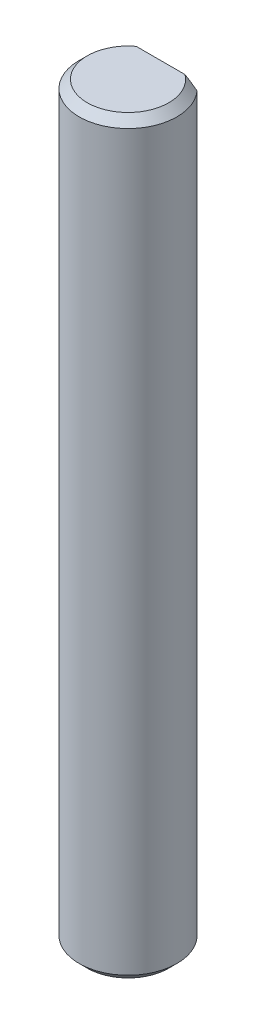
ISO-10303-21;
HEADER;
FILE_DESCRIPTION(('STEP AP214'),'2;1');
FILE_NAME('part.step','',(''),(''),'','','');
FILE_SCHEMA(('AUTOMOTIVE_DESIGN { 1 0 10303 214 1 1 1 1 }'));
ENDSEC;
DATA;
#1=APPLICATION_CONTEXT('core data for automotive mechanical design processes');
#2=APPLICATION_PROTOCOL_DEFINITION('international standard','automotive_design',2000,#1);
#3=PRODUCT_CONTEXT('',#1,'mechanical');
#4=PRODUCT('Part','Part','',(#3));
#5=PRODUCT_RELATED_PRODUCT_CATEGORY('part','',(#4));
#6=PRODUCT_DEFINITION_FORMATION('','',#4);
#7=PRODUCT_DEFINITION_CONTEXT('part definition',#1,'design');
#8=PRODUCT_DEFINITION('design','',#6,#7);
#9=PRODUCT_DEFINITION_SHAPE('','',#8);
#10=(LENGTH_UNIT() NAMED_UNIT(*) SI_UNIT(.MILLI.,.METRE.));
#11=(NAMED_UNIT(*) PLANE_ANGLE_UNIT() SI_UNIT($,.RADIAN.));
#12=(NAMED_UNIT(*) SI_UNIT($,.STERADIAN.) SOLID_ANGLE_UNIT());
#13=UNCERTAINTY_MEASURE_WITH_UNIT(LENGTH_MEASURE(1.E-05),#10,'distance_accuracy_value','');
#14=(GEOMETRIC_REPRESENTATION_CONTEXT(3) GLOBAL_UNCERTAINTY_ASSIGNED_CONTEXT((#13)) GLOBAL_UNIT_ASSIGNED_CONTEXT((#10,
#11,#12)) REPRESENTATION_CONTEXT('',''));
#15=CARTESIAN_POINT('',(0.,0.,0.));
#16=DIRECTION('',(0.,0.,1.));
#17=DIRECTION('',(1.,0.,0.));
#18=AXIS2_PLACEMENT_3D('',#15,#16,#17);
#19=CARTESIAN_POINT('',(0.,46.,0.));
#20=DIRECTION('',(0.,-1.,0.));
#21=DIRECTION('',(0.,0.,-1.));
#22=AXIS2_PLACEMENT_3D('',#19,#20,#21);
#23=CYLINDRICAL_SURFACE('',#22,3.);
#24=CARTESIAN_POINT('',(0.,45.5,0.));
#25=DIRECTION('',(0.,1.,0.));
#26=DIRECTION('',(0.,0.,1.));
#27=AXIS2_PLACEMENT_3D('',#24,#25,#26);
#28=CIRCLE('',#27,3.);
#29=CARTESIAN_POINT('',(2.23606797749979,45.5,-2.));
#30=VERTEX_POINT('',#29);
#31=CARTESIAN_POINT('',(-2.23606797749979,45.5,-2.));
#32=VERTEX_POINT('',#31);
#33=EDGE_CURVE('E124',#30,#32,#28,.F.);
#34=ORIENTED_EDGE('',*,*,#33,.T.);
#35=DIRECTION('',(0.,1.,0.));
#36=VECTOR('',#35,1.);
#37=CARTESIAN_POINT('',(-2.23606797749979,40.,-2.));
#38=LINE('',#37,#36);
#39=CARTESIAN_POINT('',(-2.23606797749979,40.,-2.));
#40=VERTEX_POINT('',#39);
#41=EDGE_CURVE('E119',#40,#32,#38,.T.);
#42=ORIENTED_EDGE('',*,*,#41,.F.);
#43=CARTESIAN_POINT('',(0.,40.,0.));
#44=DIRECTION('',(0.,1.,0.));
#45=DIRECTION('',(0.,0.,1.));
#46=AXIS2_PLACEMENT_3D('',#43,#44,#45);
#47=CIRCLE('',#46,3.);
#48=CARTESIAN_POINT('',(2.23606797749979,40.,-2.));
#49=VERTEX_POINT('',#48);
#50=EDGE_CURVE('E114',#49,#40,#47,.T.);
#51=ORIENTED_EDGE('',*,*,#50,.F.);
#52=DIRECTION('',(0.,1.,0.));
#53=VECTOR('',#52,1.);
#54=CARTESIAN_POINT('',(2.23606797749979,40.,-2.));
#55=LINE('',#54,#53);
#56=EDGE_CURVE('E121',#49,#30,#55,.T.);
#57=ORIENTED_EDGE('',*,*,#56,.T.);
#58=EDGE_LOOP('',(#34,#42,#51,#57));
#59=FACE_BOUND('',#58,.T.);
#60=CARTESIAN_POINT('',(0.,6.,0.));
#61=DIRECTION('',(0.,-1.,0.));
#62=DIRECTION('',(0.,0.,-1.));
#63=AXIS2_PLACEMENT_3D('',#60,#61,#62);
#64=CIRCLE('',#63,3.);
#65=CARTESIAN_POINT('',(-2.23606797749979,6.,-2.));
#66=VERTEX_POINT('',#65);
#67=CARTESIAN_POINT('',(2.23606797749979,6.,-2.));
#68=VERTEX_POINT('',#67);
#69=EDGE_CURVE('E94',#66,#68,#64,.T.);
#70=ORIENTED_EDGE('',*,*,#69,.F.);
#71=DIRECTION('',(0.,-1.,0.));
#72=VECTOR('',#71,1.);
#73=CARTESIAN_POINT('',(-2.23606797749979,6.,-2.));
#74=LINE('',#73,#72);
#75=CARTESIAN_POINT('',(-2.23606797749979,0.499999999999986,-2.));
#76=VERTEX_POINT('',#75);
#77=EDGE_CURVE('E105',#66,#76,#74,.T.);
#78=ORIENTED_EDGE('',*,*,#77,.T.);
#79=CARTESIAN_POINT('',(0.,0.499999999999987,0.));
#80=DIRECTION('',(0.,1.,0.));
#81=DIRECTION('',(0.,0.,1.));
#82=AXIS2_PLACEMENT_3D('',#79,#80,#81);
#83=CIRCLE('',#82,3.);
#84=CARTESIAN_POINT('',(2.23606797749979,0.499999999999986,-2.));
#85=VERTEX_POINT('',#84);
#86=EDGE_CURVE('E109',#76,#85,#83,.T.);
#87=ORIENTED_EDGE('',*,*,#86,.T.);
#88=DIRECTION('',(0.,-1.,0.));
#89=VECTOR('',#88,1.);
#90=CARTESIAN_POINT('',(2.23606797749979,6.,-2.));
#91=LINE('',#90,#89);
#92=EDGE_CURVE('E103',#68,#85,#91,.T.);
#93=ORIENTED_EDGE('',*,*,#92,.F.);
#94=EDGE_LOOP('',(#70,#78,#87,#93));
#95=FACE_BOUND('',#94,.T.);
#96=ADVANCED_FACE('F35',(#59,#95),#23,.T.);
#97=CARTESIAN_POINT('',(0.,46.,0.));
#98=DIRECTION('',(0.,1.,0.));
#99=DIRECTION('',(0.,0.,1.));
#100=AXIS2_PLACEMENT_3D('',#97,#98,#99);
#101=PLANE('',#100);
#102=DIRECTION('',(1.,0.,0.));
#103=VECTOR('',#102,1.);
#104=CARTESIAN_POINT('',(-2.23606797749979,46.,-2.));
#105=LINE('',#104,#103);
#106=CARTESIAN_POINT('',(-1.49999999999999,46.,-2.));
#107=VERTEX_POINT('',#106);
#108=CARTESIAN_POINT('',(1.49999999999999,46.,-2.));
#109=VERTEX_POINT('',#108);
#110=EDGE_CURVE('E64',#107,#109,#105,.T.);
#111=ORIENTED_EDGE('',*,*,#110,.F.);
#112=CARTESIAN_POINT('',(0.,46.,0.));
#113=DIRECTION('',(0.,1.,0.));
#114=DIRECTION('',(0.,0.,1.));
#115=AXIS2_PLACEMENT_3D('',#112,#113,#114);
#116=CIRCLE('',#115,2.5);
#117=EDGE_CURVE('E132',#107,#109,#116,.T.);
#118=ORIENTED_EDGE('',*,*,#117,.T.);
#119=EDGE_LOOP('',(#111,#118));
#120=FACE_BOUND('',#119,.T.);
#121=ADVANCED_FACE('F147',(#120),#101,.T.);
#122=CARTESIAN_POINT('',(0.,0.,0.));
#123=DIRECTION('',(0.,1.,0.));
#124=DIRECTION('',(0.,0.,1.));
#125=AXIS2_PLACEMENT_3D('',#122,#123,#124);
#126=PLANE('',#125);
#127=CARTESIAN_POINT('',(0.,0.,0.));
#128=DIRECTION('',(0.,1.,0.));
#129=DIRECTION('',(0.,0.,1.));
#130=AXIS2_PLACEMENT_3D('',#127,#128,#129);
#131=CIRCLE('',#130,2.50000000000001);
#132=CARTESIAN_POINT('',(1.50000000000001,0.,-2.));
#133=VERTEX_POINT('',#132);
#134=CARTESIAN_POINT('',(-1.50000000000001,0.,-2.));
#135=VERTEX_POINT('',#134);
#136=EDGE_CURVE('E129',#133,#135,#131,.F.);
#137=ORIENTED_EDGE('',*,*,#136,.T.);
#138=DIRECTION('',(-1.,0.,0.));
#139=VECTOR('',#138,1.);
#140=CARTESIAN_POINT('',(2.23606797749979,0.,-2.));
#141=LINE('',#140,#139);
#142=EDGE_CURVE('E56',#133,#135,#141,.T.);
#143=ORIENTED_EDGE('',*,*,#142,.F.);
#144=EDGE_LOOP('',(#137,#143));
#145=FACE_BOUND('',#144,.T.);
#146=ADVANCED_FACE('F150',(#145),#126,.F.);
#147=CARTESIAN_POINT('',(0.,0.499999999999987,0.));
#148=DIRECTION('',(0.,1.,0.));
#149=DIRECTION('',(0.,0.,1.));
#150=AXIS2_PLACEMENT_3D('',#147,#148,#149);
#151=CONICAL_SURFACE('',#150,3.,0.785398163397453);
#152=CARTESIAN_POINT('',(4.93626797749979,2.82604370482345,-2.));
#153=CARTESIAN_POINT('',(4.78768381124845,2.68837368976766,-2.));
#154=CARTESIAN_POINT('',(4.63869756596273,2.55113119982971,-2.));
#155=CARTESIAN_POINT('',(4.33955728207182,2.27785959364789,-2.));
#156=CARTESIAN_POINT('',(4.18940299398388,2.14183075073358,-2.));
#157=CARTESIAN_POINT('',(3.88672415849227,1.87059566301389,-2.));
#158=CARTESIAN_POINT('',(3.7341908006299,1.7353992269704,-2.));
#159=CARTESIAN_POINT('',(3.42713160304089,1.46731608937021,-2.));
#160=CARTESIAN_POINT('',(3.27260600039062,1.33442911732738,-2.));
#161=CARTESIAN_POINT('',(2.99210640438999,1.09835839481656,-2.));
#162=CARTESIAN_POINT('',(2.86663901089742,0.994574818897588,-2.));
#163=CARTESIAN_POINT('',(2.61328277643715,0.789932737994831,-2.));
#164=CARTESIAN_POINT('',(2.48539335700055,0.689074946737508,-2.));
#165=CARTESIAN_POINT('',(2.22650548443354,0.49170095809527,-2.));
#166=CARTESIAN_POINT('',(2.09551089088955,0.395179762603721,-2.));
#167=CARTESIAN_POINT('',(1.89566419584527,0.255232880908247,-2.));
#168=CARTESIAN_POINT('',(1.82850179908416,0.209397498603816,-2.));
#169=CARTESIAN_POINT('',(1.69284128038712,0.119754130381662,-2.));
#170=CARTESIAN_POINT('',(1.62434330762087,0.0759459198731361,-2.));
#171=CARTESIAN_POINT('',(1.48797798387183,-0.00775682874264002,-2.));
#172=CARTESIAN_POINT('',(1.42016017631462,-0.0477316201661353,-2.));
#173=CARTESIAN_POINT('',(1.28282423563597,-0.124626643767986,-2.));
#174=CARTESIAN_POINT('',(1.21330649334522,-0.161547569660685,-2.));
#175=CARTESIAN_POINT('',(1.07234023444369,-0.231481521111825,-2.));
#176=CARTESIAN_POINT('',(1.00089253778239,-0.264496175162971,-2.));
#177=CARTESIAN_POINT('',(0.855927305144263,-0.325540113374135,-2.));
#178=CARTESIAN_POINT('',(0.782410354510816,-0.353570791289315,-2.));
#179=CARTESIAN_POINT('',(0.591196656014601,-0.417328117031226,-2.));
#180=CARTESIAN_POINT('',(0.471874440503037,-0.448536680530038,-2.));
#181=CARTESIAN_POINT('',(0.290464949037761,-0.479898553780389,-2.));
#182=CARTESIAN_POINT('',(0.229673626127372,-0.487777090114244,-2.));
#183=CARTESIAN_POINT('',(0.107614500574347,-0.498027688038355,-2.));
#184=CARTESIAN_POINT('',(0.0463467263164137,-0.500400075175091,-2.));
#185=CARTESIAN_POINT('',(-0.0763197942470407,-0.499487634050695,-2.));
#186=CARTESIAN_POINT('',(-0.137718411127137,-0.496186533130213,-2.));
#187=CARTESIAN_POINT('',(-0.259968375583744,-0.484092732786267,-2.));
#188=CARTESIAN_POINT('',(-0.320819679690596,-0.475299601004359,-2.));
#189=CARTESIAN_POINT('',(-0.44175838695728,-0.452658497266692,-2.));
#190=CARTESIAN_POINT('',(-0.501842803788251,-0.438794793454518,-2.));
#191=CARTESIAN_POINT('',(-0.620801694696727,-0.406649794771817,-2.));
#192=CARTESIAN_POINT('',(-0.67967611073821,-0.388368288541527,-2.));
#193=CARTESIAN_POINT('',(-0.86701017813372,-0.323533738489998,-2.));
#194=CARTESIAN_POINT('',(-0.992934833748161,-0.269655609127033,-2.));
#195=CARTESIAN_POINT('',(-1.23892735531403,-0.149819458396308,-2.));
#196=CARTESIAN_POINT('',(-1.35898276485906,-0.0838370471122683,-2.));
#197=CARTESIAN_POINT('',(-1.59585458502194,0.0568706299241704,-2.));
#198=CARTESIAN_POINT('',(-1.71261073718886,0.131696016975801,-2.));
#199=CARTESIAN_POINT('',(-1.94233316376558,0.28666304081192,-2.));
#200=CARTESIAN_POINT('',(-2.05530279263014,0.366799774261722,-2.));
#201=CARTESIAN_POINT('',(-2.29310526083198,0.5415463860401,-2.));
#202=CARTESIAN_POINT('',(-2.41755314631462,0.636676886479159,-2.));
#203=CARTESIAN_POINT('',(-2.66387185446494,0.830229640965983,-2.));
#204=CARTESIAN_POINT('',(-2.78574230894004,0.92865236019998,-2.));
#205=CARTESIAN_POINT('',(-3.0276493524681,1.12794190456691,-2.));
#206=CARTESIAN_POINT('',(-3.14768415452679,1.22881089132875,-2.));
#207=CARTESIAN_POINT('',(-3.38626695152414,1.43229327553111,-2.));
#208=CARTESIAN_POINT('',(-3.50481490892545,1.53490671685923,-2.));
#209=CARTESIAN_POINT('',(-3.73393503767578,1.73549166400829,-2.));
#210=CARTESIAN_POINT('',(-3.84457235346527,1.83338890289208,-2.));
#211=CARTESIAN_POINT('',(-4.0650206650625,2.03011275945683,-2.));
#212=CARTESIAN_POINT('',(-4.17483164429525,2.12893939569105,-2.));
#213=CARTESIAN_POINT('',(-4.39356418106757,2.32713838699398,-2.));
#214=CARTESIAN_POINT('',(-4.50248706778863,2.42650927692172,-2.));
#215=CARTESIAN_POINT('',(-4.71977019005837,2.62585506813547,-2.));
#216=CARTESIAN_POINT('',(-4.82813044992246,2.7258299429078,-2.));
#217=CARTESIAN_POINT('',(-4.93626797749979,2.82604370482345,-2.));
#218=B_SPLINE_CURVE_WITH_KNOTS('',3,(#152,#153,#154,#155,#156,#157,#158,#159,#160,#161,#162,
#163,#164,#165,#166,#167,#168,#169,#170,#171,#172,#173,#174,#175,#176,#177,#178,#179,#180,#181,
#182,#183,#184,#185,#186,#187,#188,#189,#190,#191,#192,#193,#194,#195,#196,#197,#198,#199,#200,
#201,#202,#203,#204,#205,#206,#207,#208,#209,#210,#211,#212,#213,#214,#215,#216,#217),
.UNSPECIFIED.,.F.,.F.,(4,2,2,2,2,2,2,2,2,2,2,2,2,2,2,2,2,2,2,2,2,2,2,2,2,2,2,2,2,2,2,2,4),(0.,
0.607683822515695,1.21550121371795,1.82695959733875,2.43834587720767,2.92679827952437,
3.41536885142093,3.9033610691761,4.14727001406464,4.39115187121074,4.62725676477007,
4.86330787673309,5.09926023157597,5.33514649886009,5.70350071953635,5.88718743593394,
6.07086329173091,6.25506684494244,6.43928490135031,6.6240794258677,6.80888279321207,
7.21864694206687,7.62924601323274,8.04504397302751,8.46046328332829,8.9303110162863,
9.40022542091197,9.87057139026387,10.3409292103109,10.7841162696073,11.2273121949651,
11.6696319276303,12.1119323824531),.UNSPECIFIED.);
#219=EDGE_CURVE('E11',#85,#133,#218,.T.);
#220=ORIENTED_EDGE('',*,*,#219,.F.);
#221=ORIENTED_EDGE('',*,*,#86,.F.);
#222=EDGE_CURVE('E41',#135,#76,#218,.T.);
#223=ORIENTED_EDGE('',*,*,#222,.F.);
#224=ORIENTED_EDGE('',*,*,#136,.F.);
#225=EDGE_LOOP('',(#220,#221,#223,#224));
#226=FACE_BOUND('',#225,.T.);
#227=ADVANCED_FACE('F154',(#226),#151,.T.);
#228=CARTESIAN_POINT('',(0.,46.,0.));
#229=DIRECTION('',(0.,-1.,0.));
#230=DIRECTION('',(0.,0.,-1.));
#231=AXIS2_PLACEMENT_3D('',#228,#229,#230);
#232=CONICAL_SURFACE('',#231,2.5,0.785398163397453);
#233=CARTESIAN_POINT('',(-4.93626797749979,43.1739562951765,-2.));
#234=CARTESIAN_POINT('',(-4.78768381124845,43.3116263102323,-2.));
#235=CARTESIAN_POINT('',(-4.63869756596274,43.4488688001703,-2.));
#236=CARTESIAN_POINT('',(-4.33955728207182,43.7221404063521,-2.));
#237=CARTESIAN_POINT('',(-4.18940299398388,43.8581692492664,-2.));
#238=CARTESIAN_POINT('',(-3.88672415849227,44.1294043369861,-2.));
#239=CARTESIAN_POINT('',(-3.7341908006299,44.2646007730296,-2.));
#240=CARTESIAN_POINT('',(-3.42713160304089,44.5326839106298,-2.));
#241=CARTESIAN_POINT('',(-3.27260600039062,44.6655708826726,-2.));
#242=CARTESIAN_POINT('',(-2.99210640438999,44.9016416051834,-2.));
#243=CARTESIAN_POINT('',(-2.86663901089742,45.0054251811024,-2.));
#244=CARTESIAN_POINT('',(-2.61328277643715,45.2100672620052,-2.));
#245=CARTESIAN_POINT('',(-2.48539335700055,45.3109250532625,-2.));
#246=CARTESIAN_POINT('',(-2.22650548443354,45.5082990419047,-2.));
#247=CARTESIAN_POINT('',(-2.09551089088956,45.6048202373963,-2.));
#248=CARTESIAN_POINT('',(-1.89566419584527,45.7447671190917,-2.));
#249=CARTESIAN_POINT('',(-1.82850179908417,45.7906025013962,-2.));
#250=CARTESIAN_POINT('',(-1.69284128038712,45.8802458696183,-2.));
#251=CARTESIAN_POINT('',(-1.62434330762088,45.9240540801269,-2.));
#252=CARTESIAN_POINT('',(-1.48797798387183,46.0077568287426,-2.));
#253=CARTESIAN_POINT('',(-1.42016017631463,46.0477316201661,-2.));
#254=CARTESIAN_POINT('',(-1.28282423563598,46.124626643768,-2.));
#255=CARTESIAN_POINT('',(-1.21330649334522,46.1615475696607,-2.));
#256=CARTESIAN_POINT('',(-1.07234023444369,46.2314815211118,-2.));
#257=CARTESIAN_POINT('',(-1.00089253778239,46.2644961751629,-2.));
#258=CARTESIAN_POINT('',(-0.855927305144264,46.3255401133741,-2.));
#259=CARTESIAN_POINT('',(-0.782410354510816,46.3535707912893,-2.));
#260=CARTESIAN_POINT('',(-0.5911966560146,46.4173281170312,-2.));
#261=CARTESIAN_POINT('',(-0.471874440503036,46.44853668053,-2.));
#262=CARTESIAN_POINT('',(-0.290464949037759,46.4798985537804,-2.));
#263=CARTESIAN_POINT('',(-0.229673626127371,46.4877770901142,-2.));
#264=CARTESIAN_POINT('',(-0.107614500574347,46.4980276880383,-2.));
#265=CARTESIAN_POINT('',(-0.0463467263164124,46.5004000751751,-2.));
#266=CARTESIAN_POINT('',(0.0763197942470421,46.4994876340507,-2.));
#267=CARTESIAN_POINT('',(0.137718411127138,46.4961865331302,-2.));
#268=CARTESIAN_POINT('',(0.259968375583744,46.4840927327863,-2.));
#269=CARTESIAN_POINT('',(0.320819679690597,46.4752996010043,-2.));
#270=CARTESIAN_POINT('',(0.441758386957281,46.4526584972667,-2.));
#271=CARTESIAN_POINT('',(0.501842803788252,46.4387947934545,-2.));
#272=CARTESIAN_POINT('',(0.620801694696729,46.4066497947718,-2.));
#273=CARTESIAN_POINT('',(0.679676110738212,46.3883682885415,-2.));
#274=CARTESIAN_POINT('',(0.867010178133724,46.32353373849,-2.));
#275=CARTESIAN_POINT('',(0.992934833748166,46.269655609127,-2.));
#276=CARTESIAN_POINT('',(1.23892735531404,46.1498194583963,-2.));
#277=CARTESIAN_POINT('',(1.35898276485907,46.0838370471122,-2.));
#278=CARTESIAN_POINT('',(1.59585458502195,45.9431293700758,-2.));
#279=CARTESIAN_POINT('',(1.71261073718887,45.8683039830242,-2.));
#280=CARTESIAN_POINT('',(1.94233316376559,45.7133369591881,-2.));
#281=CARTESIAN_POINT('',(2.05530279263015,45.6332002257383,-2.));
#282=CARTESIAN_POINT('',(2.29310526083199,45.4584536139599,-2.));
#283=CARTESIAN_POINT('',(2.41755314631463,45.3633231135208,-2.));
#284=CARTESIAN_POINT('',(2.66387185446494,45.169770359034,-2.));
#285=CARTESIAN_POINT('',(2.78574230894005,45.0713476398,-2.));
#286=CARTESIAN_POINT('',(3.02764935246812,44.8720580954331,-2.));
#287=CARTESIAN_POINT('',(3.14768415452681,44.7711891086712,-2.));
#288=CARTESIAN_POINT('',(3.38626695152415,44.5677067244689,-2.));
#289=CARTESIAN_POINT('',(3.50481490892546,44.4650932831407,-2.));
#290=CARTESIAN_POINT('',(3.73393503767579,44.2645083359917,-2.));
#291=CARTESIAN_POINT('',(3.84457235346528,44.1666110971079,-2.));
#292=CARTESIAN_POINT('',(4.06502066506251,43.9698872405431,-2.));
#293=CARTESIAN_POINT('',(4.17483164429526,43.8710606043089,-2.));
#294=CARTESIAN_POINT('',(4.39356418106757,43.672861613006,-2.));
#295=CARTESIAN_POINT('',(4.50248706778863,43.5734907230783,-2.));
#296=CARTESIAN_POINT('',(4.71977019005837,43.3741449318645,-2.));
#297=CARTESIAN_POINT('',(4.82813044992246,43.2741700570922,-2.));
#298=CARTESIAN_POINT('',(4.93626797749979,43.1739562951765,-2.));
#299=B_SPLINE_CURVE_WITH_KNOTS('',3,(#233,#234,#235,#236,#237,#238,#239,#240,#241,#242,#243,
#244,#245,#246,#247,#248,#249,#250,#251,#252,#253,#254,#255,#256,#257,#258,#259,#260,#261,#262,
#263,#264,#265,#266,#267,#268,#269,#270,#271,#272,#273,#274,#275,#276,#277,#278,#279,#280,#281,
#282,#283,#284,#285,#286,#287,#288,#289,#290,#291,#292,#293,#294,#295,#296,#297,#298),
.UNSPECIFIED.,.F.,.F.,(4,2,2,2,2,2,2,2,2,2,2,2,2,2,2,2,2,2,2,2,2,2,2,2,2,2,2,2,2,2,2,2,4),(0.,
0.607683822515692,1.21550121371795,1.82695959733875,2.43834587720767,2.92679827952437,
3.41536885142093,3.9033610691761,4.14727001406465,4.39115187121074,4.62725676477006,
4.86330787673309,5.09926023157597,5.3351464988601,5.70350071953636,5.88718743593395,
6.07086329173092,6.25506684494244,6.43928490135031,6.6240794258677,6.80888279321207,
7.21864694206688,7.62924601323276,8.04504397302752,8.46046328332831,8.93031101628632,
9.40022542091199,9.87057139026389,10.3409292103109,10.7841162696073,11.2273121949651,
11.6696319276303,12.1119323824531),.UNSPECIFIED.);
#300=EDGE_CURVE('E140',#32,#107,#299,.T.);
#301=ORIENTED_EDGE('',*,*,#300,.F.);
#302=ORIENTED_EDGE('',*,*,#33,.F.);
#303=EDGE_CURVE('E134',#109,#30,#299,.T.);
#304=ORIENTED_EDGE('',*,*,#303,.F.);
#305=ORIENTED_EDGE('',*,*,#117,.F.);
#306=EDGE_LOOP('',(#301,#302,#304,#305));
#307=FACE_BOUND('',#306,.T.);
#308=ADVANCED_FACE('F38',(#307),#232,.T.);
#309=CARTESIAN_POINT('',(-2.23606797749979,40.,-2.));
#310=DIRECTION('',(0.,0.,1.));
#311=DIRECTION('',(1.,0.,0.));
#312=AXIS2_PLACEMENT_3D('',#309,#310,#311);
#313=PLANE('',#312);
#314=ORIENTED_EDGE('',*,*,#300,.T.);
#315=ORIENTED_EDGE('',*,*,#110,.T.);
#316=ORIENTED_EDGE('',*,*,#303,.T.);
#317=ORIENTED_EDGE('',*,*,#56,.F.);
#318=DIRECTION('',(1.,0.,0.));
#319=VECTOR('',#318,1.);
#320=CARTESIAN_POINT('',(-2.23606797749979,40.,-2.));
#321=LINE('',#320,#319);
#322=EDGE_CURVE('E116',#40,#49,#321,.T.);
#323=ORIENTED_EDGE('',*,*,#322,.F.);
#324=ORIENTED_EDGE('',*,*,#41,.T.);
#325=EDGE_LOOP('',(#314,#315,#316,#317,#323,#324));
#326=FACE_BOUND('',#325,.T.);
#327=ADVANCED_FACE('F141',(#326),#313,.F.);
#328=CARTESIAN_POINT('',(0.,40.,0.));
#329=DIRECTION('',(0.,1.,0.));
#330=DIRECTION('',(0.,0.,1.));
#331=AXIS2_PLACEMENT_3D('',#328,#329,#330);
#332=PLANE('',#331);
#333=ORIENTED_EDGE('',*,*,#50,.T.);
#334=ORIENTED_EDGE('',*,*,#322,.T.);
#335=EDGE_LOOP('',(#333,#334));
#336=FACE_BOUND('',#335,.T.);
#337=ADVANCED_FACE('F146',(#336),#332,.T.);
#338=CARTESIAN_POINT('',(2.23606797749979,6.,-2.));
#339=DIRECTION('',(0.,0.,1.));
#340=DIRECTION('',(1.,0.,0.));
#341=AXIS2_PLACEMENT_3D('',#338,#339,#340);
#342=PLANE('',#341);
#343=ORIENTED_EDGE('',*,*,#219,.T.);
#344=ORIENTED_EDGE('',*,*,#142,.T.);
#345=ORIENTED_EDGE('',*,*,#222,.T.);
#346=ORIENTED_EDGE('',*,*,#77,.F.);
#347=DIRECTION('',(-1.,0.,0.));
#348=VECTOR('',#347,1.);
#349=CARTESIAN_POINT('',(2.23606797749979,6.,-2.));
#350=LINE('',#349,#348);
#351=EDGE_CURVE('E97',#68,#66,#350,.T.);
#352=ORIENTED_EDGE('',*,*,#351,.F.);
#353=ORIENTED_EDGE('',*,*,#92,.T.);
#354=EDGE_LOOP('',(#343,#344,#345,#346,#352,#353));
#355=FACE_BOUND('',#354,.T.);
#356=ADVANCED_FACE('F102',(#355),#342,.F.);
#357=CARTESIAN_POINT('',(0.,6.,0.));
#358=DIRECTION('',(0.,-1.,0.));
#359=DIRECTION('',(0.,0.,-1.));
#360=AXIS2_PLACEMENT_3D('',#357,#358,#359);
#361=PLANE('',#360);
#362=ORIENTED_EDGE('',*,*,#69,.T.);
#363=ORIENTED_EDGE('',*,*,#351,.T.);
#364=EDGE_LOOP('',(#362,#363));
#365=FACE_BOUND('',#364,.T.);
#366=ADVANCED_FACE('F96',(#365),#361,.T.);
#367=CLOSED_SHELL('',(#96,#121,#146,#227,#308,#327,#337,#356,#366));
#368=MANIFOLD_SOLID_BREP('B2',#367);
#369=ADVANCED_BREP_SHAPE_REPRESENTATION('',(#18,#368),#14);
#370=SHAPE_DEFINITION_REPRESENTATION(#9,#369);
ENDSEC;
END-ISO-10303-21;
